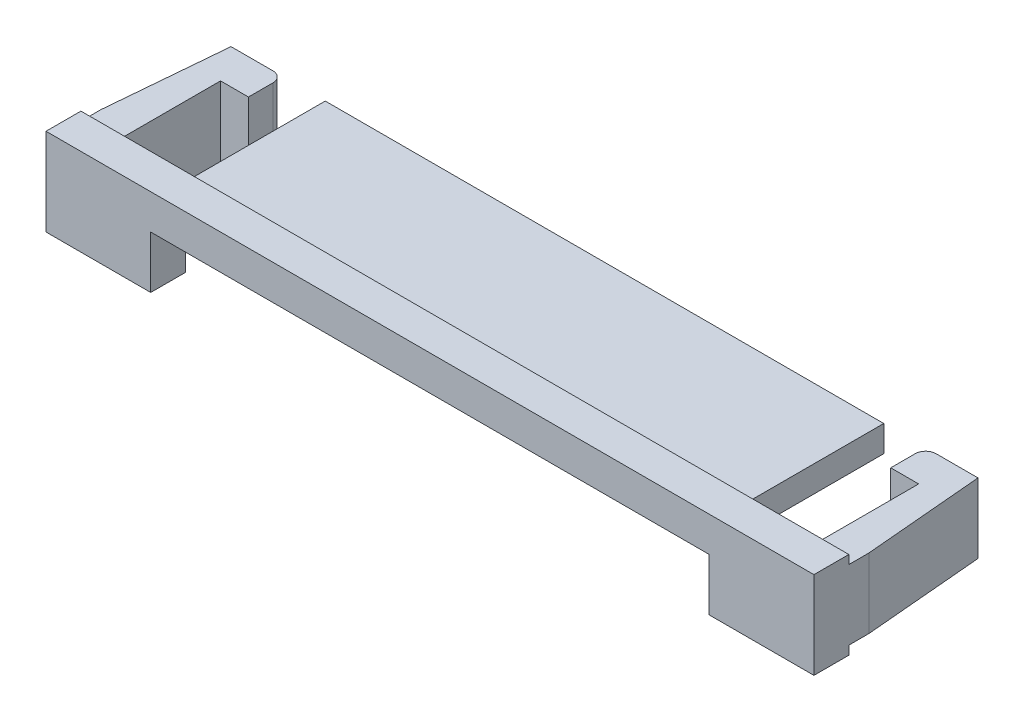
ISO-10303-21;
HEADER;
FILE_DESCRIPTION(('STEP AP214'),'2;1');
FILE_NAME('part.step','',(''),(''),'','','');
FILE_SCHEMA(('AUTOMOTIVE_DESIGN { 1 0 10303 214 1 1 1 1 }'));
ENDSEC;
DATA;
#1=APPLICATION_CONTEXT('core data for automotive mechanical design processes');
#2=APPLICATION_PROTOCOL_DEFINITION('international standard','automotive_design',2000,#1);
#3=PRODUCT_CONTEXT('',#1,'mechanical');
#4=PRODUCT('Part','Part','',(#3));
#5=PRODUCT_RELATED_PRODUCT_CATEGORY('part','',(#4));
#6=PRODUCT_DEFINITION_FORMATION('','',#4);
#7=PRODUCT_DEFINITION_CONTEXT('part definition',#1,'design');
#8=PRODUCT_DEFINITION('design','',#6,#7);
#9=PRODUCT_DEFINITION_SHAPE('','',#8);
#10=(LENGTH_UNIT() NAMED_UNIT(*) SI_UNIT(.MILLI.,.METRE.));
#11=(NAMED_UNIT(*) PLANE_ANGLE_UNIT() SI_UNIT($,.RADIAN.));
#12=(NAMED_UNIT(*) SI_UNIT($,.STERADIAN.) SOLID_ANGLE_UNIT());
#13=UNCERTAINTY_MEASURE_WITH_UNIT(LENGTH_MEASURE(1.E-05),#10,'distance_accuracy_value','');
#14=(GEOMETRIC_REPRESENTATION_CONTEXT(3) GLOBAL_UNCERTAINTY_ASSIGNED_CONTEXT((#13)) GLOBAL_UNIT_ASSIGNED_CONTEXT((#10,
#11,#12)) REPRESENTATION_CONTEXT('',''));
#15=CARTESIAN_POINT('',(0.,0.,0.));
#16=DIRECTION('',(0.,0.,1.));
#17=DIRECTION('',(1.,0.,0.));
#18=AXIS2_PLACEMENT_3D('',#15,#16,#17);
#19=CARTESIAN_POINT('',(-11.,-1.25,5.));
#20=DIRECTION('',(0.,1.,0.));
#21=DIRECTION('',(0.,0.,1.));
#22=AXIS2_PLACEMENT_3D('',#19,#20,#21);
#23=PLANE('',#22);
#24=DIRECTION('',(1.,0.,0.));
#25=VECTOR('',#24,1.);
#26=CARTESIAN_POINT('',(-11.,-1.25,5.));
#27=LINE('',#26,#25);
#28=CARTESIAN_POINT('',(8.,-1.25,5.));
#29=VERTEX_POINT('',#28);
#30=CARTESIAN_POINT('',(11.,-1.25,5.));
#31=VERTEX_POINT('',#30);
#32=EDGE_CURVE('E414',#29,#31,#27,.T.);
#33=ORIENTED_EDGE('',*,*,#32,.F.);
#34=DIRECTION('',(0.,0.,-1.));
#35=VECTOR('',#34,1.);
#36=CARTESIAN_POINT('',(8.,-1.25,5.));
#37=LINE('',#36,#35);
#38=CARTESIAN_POINT('',(8.,-1.25,4.));
#39=VERTEX_POINT('',#38);
#40=EDGE_CURVE('E285',#29,#39,#37,.T.);
#41=ORIENTED_EDGE('',*,*,#40,.T.);
#42=DIRECTION('',(-1.,0.,0.));
#43=VECTOR('',#42,1.);
#44=CARTESIAN_POINT('',(-11.,-1.25,4.));
#45=LINE('',#44,#43);
#46=CARTESIAN_POINT('',(11.,-1.25,4.));
#47=VERTEX_POINT('',#46);
#48=EDGE_CURVE('E392',#47,#39,#45,.T.);
#49=ORIENTED_EDGE('',*,*,#48,.F.);
#50=DIRECTION('',(0.,0.,-1.));
#51=VECTOR('',#50,1.);
#52=CARTESIAN_POINT('',(11.,-1.25,5.));
#53=LINE('',#52,#51);
#54=EDGE_CURVE('E419',#31,#47,#53,.T.);
#55=ORIENTED_EDGE('',*,*,#54,.F.);
#56=EDGE_LOOP('',(#33,#41,#49,#55));
#57=FACE_BOUND('',#56,.T.);
#58=ADVANCED_FACE('F38',(#57),#23,.F.);
#59=CARTESIAN_POINT('',(0.,0.,0.));
#60=DIRECTION('',(0.,0.,1.));
#61=DIRECTION('',(1.,0.,0.));
#62=AXIS2_PLACEMENT_3D('',#59,#60,#61);
#63=PLANE('',#62);
#64=DIRECTION('',(-1.,0.,0.));
#65=VECTOR('',#64,1.);
#66=CARTESIAN_POINT('',(11.,1.,0.));
#67=LINE('',#66,#65);
#68=CARTESIAN_POINT('',(10.7,1.,0.));
#69=VERTEX_POINT('',#68);
#70=CARTESIAN_POINT('',(9.5,1.,0.));
#71=VERTEX_POINT('',#70);
#72=EDGE_CURVE('E353',#69,#71,#67,.T.);
#73=ORIENTED_EDGE('',*,*,#72,.F.);
#74=DIRECTION('',(0.,-1.,0.));
#75=VECTOR('',#74,1.);
#76=CARTESIAN_POINT('',(10.7,0.,0.));
#77=LINE('',#76,#75);
#78=CARTESIAN_POINT('',(10.7,-1.,0.));
#79=VERTEX_POINT('',#78);
#80=EDGE_CURVE('E478',#69,#79,#77,.T.);
#81=ORIENTED_EDGE('',*,*,#80,.T.);
#82=DIRECTION('',(1.,0.,0.));
#83=VECTOR('',#82,1.);
#84=CARTESIAN_POINT('',(-11.,-1.,0.));
#85=LINE('',#84,#83);
#86=CARTESIAN_POINT('',(9.5,-1.,0.));
#87=VERTEX_POINT('',#86);
#88=EDGE_CURVE('E321',#87,#79,#85,.T.);
#89=ORIENTED_EDGE('',*,*,#88,.F.);
#90=DIRECTION('',(0.,1.,0.));
#91=VECTOR('',#90,1.);
#92=CARTESIAN_POINT('',(9.5,1.,0.));
#93=LINE('',#92,#91);
#94=EDGE_CURVE('E446',#87,#71,#93,.T.);
#95=ORIENTED_EDGE('',*,*,#94,.T.);
#96=EDGE_LOOP('',(#73,#81,#89,#95));
#97=FACE_BOUND('',#96,.T.);
#98=ADVANCED_FACE('F581',(#97),#63,.F.);
#99=CARTESIAN_POINT('',(-10.7,-1.,0.));
#100=VERTEX_POINT('',#99);
#101=CARTESIAN_POINT('',(-9.5,-1.,0.));
#102=VERTEX_POINT('',#101);
#103=EDGE_CURVE('E383',#100,#102,#85,.T.);
#104=ORIENTED_EDGE('',*,*,#103,.F.);
#105=DIRECTION('',(0.,1.,0.));
#106=VECTOR('',#105,1.);
#107=CARTESIAN_POINT('',(-10.7,0.,0.));
#108=LINE('',#107,#106);
#109=CARTESIAN_POINT('',(-10.7,1.,0.));
#110=VERTEX_POINT('',#109);
#111=EDGE_CURVE('E47',#100,#110,#108,.T.);
#112=ORIENTED_EDGE('',*,*,#111,.T.);
#113=CARTESIAN_POINT('',(-9.5,1.,0.));
#114=VERTEX_POINT('',#113);
#115=EDGE_CURVE('E369',#114,#110,#67,.T.);
#116=ORIENTED_EDGE('',*,*,#115,.F.);
#117=DIRECTION('',(0.,1.,0.));
#118=VECTOR('',#117,1.);
#119=CARTESIAN_POINT('',(-9.5,-1.,0.));
#120=LINE('',#119,#118);
#121=EDGE_CURVE('E464',#114,#102,#120,.F.);
#122=ORIENTED_EDGE('',*,*,#121,.T.);
#123=EDGE_LOOP('',(#104,#112,#116,#122));
#124=FACE_BOUND('',#123,.T.);
#125=ADVANCED_FACE('F587',(#124),#63,.F.);
#126=CARTESIAN_POINT('',(-11.,-1.,4.));
#127=DIRECTION('',(0.,1.,0.));
#128=DIRECTION('',(-1.,0.,0.));
#129=AXIS2_PLACEMENT_3D('',#126,#127,#128);
#130=PLANE('',#129);
#131=ORIENTED_EDGE('',*,*,#88,.T.);
#132=DIRECTION('',(-0.0871557427476589,0.,-0.996194698091746));
#133=VECTOR('',#132,1.);
#134=CARTESIAN_POINT('',(11.,-1.,3.42901569082837));
#135=LINE('',#134,#133);
#136=CARTESIAN_POINT('',(11.,-1.,3.42901569082837));
#137=VERTEX_POINT('',#136);
#138=EDGE_CURVE('E481',#79,#137,#135,.F.);
#139=ORIENTED_EDGE('',*,*,#138,.T.);
#140=DIRECTION('',(0.,0.,-1.));
#141=VECTOR('',#140,1.);
#142=CARTESIAN_POINT('',(11.,-1.,4.));
#143=LINE('',#142,#141);
#144=CARTESIAN_POINT('',(11.,-1.,4.));
#145=VERTEX_POINT('',#144);
#146=EDGE_CURVE('E399',#145,#137,#143,.T.);
#147=ORIENTED_EDGE('',*,*,#146,.F.);
#148=DIRECTION('',(1.,0.,0.));
#149=VECTOR('',#148,1.);
#150=CARTESIAN_POINT('',(-11.,-1.,4.));
#151=LINE('',#150,#149);
#152=CARTESIAN_POINT('',(10.,-1.,4.));
#153=VERTEX_POINT('',#152);
#154=EDGE_CURVE('E382',#153,#145,#151,.T.);
#155=ORIENTED_EDGE('',*,*,#154,.F.);
#156=DIRECTION('',(0.,0.,-1.));
#157=VECTOR('',#156,1.);
#158=CARTESIAN_POINT('',(10.,-1.,4.));
#159=LINE('',#158,#157);
#160=CARTESIAN_POINT('',(10.,-1.,1.));
#161=VERTEX_POINT('',#160);
#162=EDGE_CURVE('E244',#153,#161,#159,.T.);
#163=ORIENTED_EDGE('',*,*,#162,.T.);
#164=DIRECTION('',(1.,0.,0.));
#165=VECTOR('',#164,1.);
#166=CARTESIAN_POINT('',(11.,-1.,1.));
#167=LINE('',#166,#165);
#168=CARTESIAN_POINT('',(9.2,-1.,1.));
#169=VERTEX_POINT('',#168);
#170=EDGE_CURVE('E229',#169,#161,#167,.T.);
#171=ORIENTED_EDGE('',*,*,#170,.F.);
#172=DIRECTION('',(0.,0.,1.));
#173=VECTOR('',#172,1.);
#174=CARTESIAN_POINT('',(9.2,-1.,0.));
#175=LINE('',#174,#173);
#176=CARTESIAN_POINT('',(9.2,-1.,0.3));
#177=VERTEX_POINT('',#176);
#178=EDGE_CURVE('E217',#177,#169,#175,.T.);
#179=ORIENTED_EDGE('',*,*,#178,.F.);
#180=CARTESIAN_POINT('',(9.5,-1.,0.3));
#181=DIRECTION('',(0.,1.,0.));
#182=DIRECTION('',(-1.,0.,0.));
#183=AXIS2_PLACEMENT_3D('',#180,#181,#182);
#184=CIRCLE('',#183,0.3);
#185=EDGE_CURVE('E455',#177,#87,#184,.F.);
#186=ORIENTED_EDGE('',*,*,#185,.T.);
#187=EDGE_LOOP('',(#131,#139,#147,#155,#163,#171,#179,#186));
#188=FACE_BOUND('',#187,.T.);
#189=ADVANCED_FACE('F242',(#188),#130,.F.);
#190=DIRECTION('',(0.,0.,-1.));
#191=VECTOR('',#190,1.);
#192=CARTESIAN_POINT('',(-11.,-1.,4.));
#193=LINE('',#192,#191);
#194=CARTESIAN_POINT('',(-11.,-1.,4.));
#195=VERTEX_POINT('',#194);
#196=CARTESIAN_POINT('',(-11.,-1.,3.42901569082837));
#197=VERTEX_POINT('',#196);
#198=EDGE_CURVE('E396',#195,#197,#193,.T.);
#199=ORIENTED_EDGE('',*,*,#198,.T.);
#200=DIRECTION('',(-0.0871557427476589,0.,0.996194698091746));
#201=VECTOR('',#200,1.);
#202=CARTESIAN_POINT('',(-11.,-1.,3.42901569082837));
#203=LINE('',#202,#201);
#204=EDGE_CURVE('E61',#197,#100,#203,.F.);
#205=ORIENTED_EDGE('',*,*,#204,.T.);
#206=ORIENTED_EDGE('',*,*,#103,.T.);
#207=CARTESIAN_POINT('',(-9.5,-1.,0.3));
#208=DIRECTION('',(0.,1.,0.));
#209=DIRECTION('',(-1.,0.,0.));
#210=AXIS2_PLACEMENT_3D('',#207,#208,#209);
#211=CIRCLE('',#210,0.3);
#212=CARTESIAN_POINT('',(-9.2,-1.,0.3));
#213=VERTEX_POINT('',#212);
#214=EDGE_CURVE('E468',#102,#213,#211,.F.);
#215=ORIENTED_EDGE('',*,*,#214,.T.);
#216=DIRECTION('',(0.,0.,-1.));
#217=VECTOR('',#216,1.);
#218=CARTESIAN_POINT('',(-9.2,-1.,0.));
#219=LINE('',#218,#217);
#220=CARTESIAN_POINT('',(-9.2,-1.,1.));
#221=VERTEX_POINT('',#220);
#222=EDGE_CURVE('E258',#221,#213,#219,.T.);
#223=ORIENTED_EDGE('',*,*,#222,.F.);
#224=DIRECTION('',(1.,0.,0.));
#225=VECTOR('',#224,1.);
#226=CARTESIAN_POINT('',(-11.,-1.,1.));
#227=LINE('',#226,#225);
#228=CARTESIAN_POINT('',(-9.99999999999999,-1.,1.));
#229=VERTEX_POINT('',#228);
#230=EDGE_CURVE('E255',#229,#221,#227,.T.);
#231=ORIENTED_EDGE('',*,*,#230,.F.);
#232=DIRECTION('',(0.,0.,-1.));
#233=VECTOR('',#232,1.);
#234=CARTESIAN_POINT('',(-9.99999999999999,-1.,4.));
#235=LINE('',#234,#233);
#236=CARTESIAN_POINT('',(-9.99999999999999,-1.,4.));
#237=VERTEX_POINT('',#236);
#238=EDGE_CURVE('E317',#237,#229,#235,.T.);
#239=ORIENTED_EDGE('',*,*,#238,.F.);
#240=EDGE_CURVE('E384',#195,#237,#151,.T.);
#241=ORIENTED_EDGE('',*,*,#240,.F.);
#242=EDGE_LOOP('',(#199,#205,#206,#215,#223,#231,#239,#241));
#243=FACE_BOUND('',#242,.T.);
#244=ADVANCED_FACE('F547',(#243),#130,.F.);
#245=CARTESIAN_POINT('',(11.,1.,4.));
#246=DIRECTION('',(0.,-1.,0.));
#247=DIRECTION('',(0.,0.,-1.));
#248=AXIS2_PLACEMENT_3D('',#245,#246,#247);
#249=PLANE('',#248);
#250=DIRECTION('',(0.,0.,-1.));
#251=VECTOR('',#250,1.);
#252=CARTESIAN_POINT('',(11.,1.,4.));
#253=LINE('',#252,#251);
#254=CARTESIAN_POINT('',(11.,1.,4.));
#255=VERTEX_POINT('',#254);
#256=CARTESIAN_POINT('',(11.,1.,3.42901569082837));
#257=VERTEX_POINT('',#256);
#258=EDGE_CURVE('E365',#255,#257,#253,.T.);
#259=ORIENTED_EDGE('',*,*,#258,.T.);
#260=DIRECTION('',(0.0871557427476589,0.,0.996194698091746));
#261=VECTOR('',#260,1.);
#262=CARTESIAN_POINT('',(11.,1.,3.42901569082837));
#263=LINE('',#262,#261);
#264=EDGE_CURVE('E475',#257,#69,#263,.F.);
#265=ORIENTED_EDGE('',*,*,#264,.T.);
#266=ORIENTED_EDGE('',*,*,#72,.T.);
#267=CARTESIAN_POINT('',(9.5,1.,0.3));
#268=DIRECTION('',(0.,-1.,0.));
#269=DIRECTION('',(0.,0.,-1.));
#270=AXIS2_PLACEMENT_3D('',#267,#268,#269);
#271=CIRCLE('',#270,0.3);
#272=CARTESIAN_POINT('',(9.2,1.,0.3));
#273=VERTEX_POINT('',#272);
#274=EDGE_CURVE('E450',#71,#273,#271,.F.);
#275=ORIENTED_EDGE('',*,*,#274,.T.);
#276=DIRECTION('',(0.,0.,1.));
#277=VECTOR('',#276,1.);
#278=CARTESIAN_POINT('',(9.2,1.,0.));
#279=LINE('',#278,#277);
#280=CARTESIAN_POINT('',(9.2,1.,1.));
#281=VERTEX_POINT('',#280);
#282=EDGE_CURVE('E250',#273,#281,#279,.T.);
#283=ORIENTED_EDGE('',*,*,#282,.T.);
#284=DIRECTION('',(1.,0.,0.));
#285=VECTOR('',#284,1.);
#286=CARTESIAN_POINT('',(11.,1.,1.));
#287=LINE('',#286,#285);
#288=CARTESIAN_POINT('',(10.,1.,1.));
#289=VERTEX_POINT('',#288);
#290=EDGE_CURVE('E230',#281,#289,#287,.T.);
#291=ORIENTED_EDGE('',*,*,#290,.T.);
#292=DIRECTION('',(0.,0.,-1.));
#293=VECTOR('',#292,1.);
#294=CARTESIAN_POINT('',(10.,1.,4.));
#295=LINE('',#294,#293);
#296=CARTESIAN_POINT('',(10.,1.,4.));
#297=VERTEX_POINT('',#296);
#298=EDGE_CURVE('E318',#297,#289,#295,.T.);
#299=ORIENTED_EDGE('',*,*,#298,.F.);
#300=DIRECTION('',(-1.,0.,0.));
#301=VECTOR('',#300,1.);
#302=CARTESIAN_POINT('',(11.,1.,4.));
#303=LINE('',#302,#301);
#304=EDGE_CURVE('E354',#255,#297,#303,.T.);
#305=ORIENTED_EDGE('',*,*,#304,.F.);
#306=EDGE_LOOP('',(#259,#265,#266,#275,#283,#291,#299,#305));
#307=FACE_BOUND('',#306,.T.);
#308=ADVANCED_FACE('F569',(#307),#249,.F.);
#309=ORIENTED_EDGE('',*,*,#115,.T.);
#310=DIRECTION('',(0.0871557427476589,0.,-0.996194698091746));
#311=VECTOR('',#310,1.);
#312=CARTESIAN_POINT('',(-11.,1.,3.42901569082837));
#313=LINE('',#312,#311);
#314=CARTESIAN_POINT('',(-11.,1.,3.42901569082837));
#315=VERTEX_POINT('',#314);
#316=EDGE_CURVE('E11',#110,#315,#313,.F.);
#317=ORIENTED_EDGE('',*,*,#316,.T.);
#318=DIRECTION('',(0.,0.,-1.));
#319=VECTOR('',#318,1.);
#320=CARTESIAN_POINT('',(-11.,1.,4.));
#321=LINE('',#320,#319);
#322=CARTESIAN_POINT('',(-11.,1.,4.));
#323=VERTEX_POINT('',#322);
#324=EDGE_CURVE('E370',#323,#315,#321,.T.);
#325=ORIENTED_EDGE('',*,*,#324,.F.);
#326=CARTESIAN_POINT('',(-9.99999999999999,1.,4.));
#327=VERTEX_POINT('',#326);
#328=EDGE_CURVE('E352',#327,#323,#303,.T.);
#329=ORIENTED_EDGE('',*,*,#328,.F.);
#330=DIRECTION('',(0.,0.,-1.));
#331=VECTOR('',#330,1.);
#332=CARTESIAN_POINT('',(-9.99999999999999,1.,4.));
#333=LINE('',#332,#331);
#334=CARTESIAN_POINT('',(-9.99999999999999,1.,1.));
#335=VERTEX_POINT('',#334);
#336=EDGE_CURVE('E335',#327,#335,#333,.T.);
#337=ORIENTED_EDGE('',*,*,#336,.T.);
#338=DIRECTION('',(1.,0.,0.));
#339=VECTOR('',#338,1.);
#340=CARTESIAN_POINT('',(-11.,1.,1.));
#341=LINE('',#340,#339);
#342=CARTESIAN_POINT('',(-9.2,1.,1.));
#343=VERTEX_POINT('',#342);
#344=EDGE_CURVE('E238',#335,#343,#341,.T.);
#345=ORIENTED_EDGE('',*,*,#344,.T.);
#346=DIRECTION('',(0.,0.,-1.));
#347=VECTOR('',#346,1.);
#348=CARTESIAN_POINT('',(-9.2,1.,0.));
#349=LINE('',#348,#347);
#350=CARTESIAN_POINT('',(-9.2,1.,0.3));
#351=VERTEX_POINT('',#350);
#352=EDGE_CURVE('E259',#343,#351,#349,.T.);
#353=ORIENTED_EDGE('',*,*,#352,.T.);
#354=CARTESIAN_POINT('',(-9.5,1.,0.3));
#355=DIRECTION('',(0.,-1.,0.));
#356=DIRECTION('',(0.,0.,-1.));
#357=AXIS2_PLACEMENT_3D('',#354,#355,#356);
#358=CIRCLE('',#357,0.3);
#359=EDGE_CURVE('E461',#351,#114,#358,.F.);
#360=ORIENTED_EDGE('',*,*,#359,.T.);
#361=EDGE_LOOP('',(#309,#317,#325,#329,#337,#345,#353,#360));
#362=FACE_BOUND('',#361,.T.);
#363=ADVANCED_FACE('F555',(#362),#249,.F.);
#364=CARTESIAN_POINT('',(-11.,1.25,5.));
#365=DIRECTION('',(0.,-1.,0.));
#366=DIRECTION('',(0.,0.,-1.));
#367=AXIS2_PLACEMENT_3D('',#364,#365,#366);
#368=PLANE('',#367);
#369=DIRECTION('',(1.,0.,0.));
#370=VECTOR('',#369,1.);
#371=CARTESIAN_POINT('',(11.,1.25,4.));
#372=LINE('',#371,#370);
#373=CARTESIAN_POINT('',(-11.,1.25,4.));
#374=VERTEX_POINT('',#373);
#375=CARTESIAN_POINT('',(11.,1.25,4.));
#376=VERTEX_POINT('',#375);
#377=EDGE_CURVE('E362',#374,#376,#372,.T.);
#378=ORIENTED_EDGE('',*,*,#377,.F.);
#379=DIRECTION('',(0.,0.,-1.));
#380=VECTOR('',#379,1.);
#381=CARTESIAN_POINT('',(-11.,1.25,5.));
#382=LINE('',#381,#380);
#383=CARTESIAN_POINT('',(-11.,1.25,5.));
#384=VERTEX_POINT('',#383);
#385=EDGE_CURVE('E427',#384,#374,#382,.T.);
#386=ORIENTED_EDGE('',*,*,#385,.F.);
#387=DIRECTION('',(-1.,0.,0.));
#388=VECTOR('',#387,1.);
#389=CARTESIAN_POINT('',(-11.,1.25,5.));
#390=LINE('',#389,#388);
#391=CARTESIAN_POINT('',(11.,1.25,5.));
#392=VERTEX_POINT('',#391);
#393=EDGE_CURVE('E408',#392,#384,#390,.T.);
#394=ORIENTED_EDGE('',*,*,#393,.F.);
#395=DIRECTION('',(0.,0.,-1.));
#396=VECTOR('',#395,1.);
#397=CARTESIAN_POINT('',(11.,1.25,5.));
#398=LINE('',#397,#396);
#399=EDGE_CURVE('E431',#392,#376,#398,.T.);
#400=ORIENTED_EDGE('',*,*,#399,.T.);
#401=EDGE_LOOP('',(#378,#386,#394,#400));
#402=FACE_BOUND('',#401,.T.);
#403=ADVANCED_FACE('F561',(#402),#368,.F.);
#404=CARTESIAN_POINT('',(-7.99999999999999,-1.25,4.));
#405=VERTEX_POINT('',#404);
#406=CARTESIAN_POINT('',(-11.,-1.25,4.));
#407=VERTEX_POINT('',#406);
#408=EDGE_CURVE('E391',#405,#407,#45,.T.);
#409=ORIENTED_EDGE('',*,*,#408,.F.);
#410=DIRECTION('',(0.,0.,-1.));
#411=VECTOR('',#410,1.);
#412=CARTESIAN_POINT('',(-7.99999999999999,-1.25,5.));
#413=LINE('',#412,#411);
#414=CARTESIAN_POINT('',(-7.99999999999999,-1.25,5.));
#415=VERTEX_POINT('',#414);
#416=EDGE_CURVE('E298',#415,#405,#413,.T.);
#417=ORIENTED_EDGE('',*,*,#416,.F.);
#418=CARTESIAN_POINT('',(-11.,-1.25,5.));
#419=VERTEX_POINT('',#418);
#420=EDGE_CURVE('E415',#419,#415,#27,.T.);
#421=ORIENTED_EDGE('',*,*,#420,.F.);
#422=DIRECTION('',(0.,0.,-1.));
#423=VECTOR('',#422,1.);
#424=CARTESIAN_POINT('',(-11.,-1.25,5.));
#425=LINE('',#424,#423);
#426=EDGE_CURVE('E423',#419,#407,#425,.T.);
#427=ORIENTED_EDGE('',*,*,#426,.T.);
#428=EDGE_LOOP('',(#409,#417,#421,#427));
#429=FACE_BOUND('',#428,.T.);
#430=ADVANCED_FACE('F539',(#429),#23,.F.);
#431=CARTESIAN_POINT('',(11.,1.25,5.));
#432=DIRECTION('',(-1.,0.,0.));
#433=DIRECTION('',(0.,0.,1.));
#434=AXIS2_PLACEMENT_3D('',#431,#432,#433);
#435=PLANE('',#434);
#436=ORIENTED_EDGE('',*,*,#146,.T.);
#437=DIRECTION('',(0.,1.,0.));
#438=VECTOR('',#437,1.);
#439=CARTESIAN_POINT('',(11.,1.25,3.42901569082837));
#440=LINE('',#439,#438);
#441=EDGE_CURVE('E471',#137,#257,#440,.T.);
#442=ORIENTED_EDGE('',*,*,#441,.T.);
#443=ORIENTED_EDGE('',*,*,#258,.F.);
#444=DIRECTION('',(0.,-1.,0.));
#445=VECTOR('',#444,1.);
#446=CARTESIAN_POINT('',(11.,1.25,4.));
#447=LINE('',#446,#445);
#448=EDGE_CURVE('E348',#376,#255,#447,.T.);
#449=ORIENTED_EDGE('',*,*,#448,.F.);
#450=ORIENTED_EDGE('',*,*,#399,.F.);
#451=DIRECTION('',(0.,1.,0.));
#452=VECTOR('',#451,1.);
#453=CARTESIAN_POINT('',(11.,1.25,5.));
#454=LINE('',#453,#452);
#455=EDGE_CURVE('E374',#31,#392,#454,.T.);
#456=ORIENTED_EDGE('',*,*,#455,.F.);
#457=ORIENTED_EDGE('',*,*,#54,.T.);
#458=DIRECTION('',(0.,-1.,0.));
#459=VECTOR('',#458,1.);
#460=CARTESIAN_POINT('',(11.,-1.25,4.));
#461=LINE('',#460,#459);
#462=EDGE_CURVE('E388',#145,#47,#461,.T.);
#463=ORIENTED_EDGE('',*,*,#462,.F.);
#464=EDGE_LOOP('',(#436,#442,#443,#449,#450,#456,#457,#463));
#465=FACE_BOUND('',#464,.T.);
#466=ADVANCED_FACE('F565',(#465),#435,.F.);
#467=CARTESIAN_POINT('',(-11.,1.25,5.));
#468=DIRECTION('',(1.,0.,0.));
#469=DIRECTION('',(0.,0.,-1.));
#470=AXIS2_PLACEMENT_3D('',#467,#468,#469);
#471=PLANE('',#470);
#472=ORIENTED_EDGE('',*,*,#324,.T.);
#473=DIRECTION('',(0.,-1.,0.));
#474=VECTOR('',#473,1.);
#475=CARTESIAN_POINT('',(-11.,1.25,3.42901569082837));
#476=LINE('',#475,#474);
#477=EDGE_CURVE('E484',#315,#197,#476,.T.);
#478=ORIENTED_EDGE('',*,*,#477,.T.);
#479=ORIENTED_EDGE('',*,*,#198,.F.);
#480=DIRECTION('',(0.,1.,0.));
#481=VECTOR('',#480,1.);
#482=CARTESIAN_POINT('',(-11.,-1.25,4.));
#483=LINE('',#482,#481);
#484=EDGE_CURVE('E378',#407,#195,#483,.T.);
#485=ORIENTED_EDGE('',*,*,#484,.F.);
#486=ORIENTED_EDGE('',*,*,#426,.F.);
#487=DIRECTION('',(0.,-1.,0.));
#488=VECTOR('',#487,1.);
#489=CARTESIAN_POINT('',(-11.,1.25,5.));
#490=LINE('',#489,#488);
#491=EDGE_CURVE('E411',#384,#419,#490,.T.);
#492=ORIENTED_EDGE('',*,*,#491,.F.);
#493=ORIENTED_EDGE('',*,*,#385,.T.);
#494=DIRECTION('',(0.,1.,0.));
#495=VECTOR('',#494,1.);
#496=CARTESIAN_POINT('',(-11.,1.25,4.));
#497=LINE('',#496,#495);
#498=EDGE_CURVE('E358',#323,#374,#497,.T.);
#499=ORIENTED_EDGE('',*,*,#498,.F.);
#500=EDGE_LOOP('',(#472,#478,#479,#485,#486,#492,#493,#499));
#501=FACE_BOUND('',#500,.T.);
#502=ADVANCED_FACE('F544',(#501),#471,.F.);
#503=CARTESIAN_POINT('',(0.,0.,5.));
#504=DIRECTION('',(0.,0.,1.));
#505=DIRECTION('',(1.,0.,0.));
#506=AXIS2_PLACEMENT_3D('',#503,#504,#505);
#507=PLANE('',#506);
#508=DIRECTION('',(0.,-1.,0.));
#509=VECTOR('',#508,1.);
#510=CARTESIAN_POINT('',(8.,0.25,5.));
#511=LINE('',#510,#509);
#512=CARTESIAN_POINT('',(8.,0.25,5.));
#513=VERTEX_POINT('',#512);
#514=EDGE_CURVE('E273',#513,#29,#511,.T.);
#515=ORIENTED_EDGE('',*,*,#514,.T.);
#516=ORIENTED_EDGE('',*,*,#32,.T.);
#517=ORIENTED_EDGE('',*,*,#455,.T.);
#518=ORIENTED_EDGE('',*,*,#393,.T.);
#519=ORIENTED_EDGE('',*,*,#491,.T.);
#520=ORIENTED_EDGE('',*,*,#420,.T.);
#521=DIRECTION('',(0.,1.,0.));
#522=VECTOR('',#521,1.);
#523=CARTESIAN_POINT('',(-7.99999999999999,0.25,5.));
#524=LINE('',#523,#522);
#525=CARTESIAN_POINT('',(-7.99999999999999,0.25,5.));
#526=VERTEX_POINT('',#525);
#527=EDGE_CURVE('E277',#415,#526,#524,.T.);
#528=ORIENTED_EDGE('',*,*,#527,.T.);
#529=DIRECTION('',(1.,0.,0.));
#530=VECTOR('',#529,1.);
#531=CARTESIAN_POINT('',(8.,0.25,5.));
#532=LINE('',#531,#530);
#533=EDGE_CURVE('E281',#526,#513,#532,.T.);
#534=ORIENTED_EDGE('',*,*,#533,.T.);
#535=EDGE_LOOP('',(#515,#516,#517,#518,#519,#520,#528,#534));
#536=FACE_BOUND('',#535,.T.);
#537=ADVANCED_FACE('F532',(#536),#507,.T.);
#538=DIRECTION('',(0.,1.,0.));
#539=VECTOR('',#538,1.);
#540=CARTESIAN_POINT('',(8.,1.,0.));
#541=LINE('',#540,#539);
#542=CARTESIAN_POINT('',(8.,0.25,0.));
#543=VERTEX_POINT('',#542);
#544=CARTESIAN_POINT('',(8.,1.,0.));
#545=VERTEX_POINT('',#544);
#546=EDGE_CURVE('E310',#543,#545,#541,.T.);
#547=ORIENTED_EDGE('',*,*,#546,.F.);
#548=DIRECTION('',(1.,0.,0.));
#549=VECTOR('',#548,1.);
#550=CARTESIAN_POINT('',(8.,0.25,0.));
#551=LINE('',#550,#549);
#552=CARTESIAN_POINT('',(-7.99999999999999,0.25,0.));
#553=VERTEX_POINT('',#552);
#554=EDGE_CURVE('E272',#553,#543,#551,.T.);
#555=ORIENTED_EDGE('',*,*,#554,.F.);
#556=DIRECTION('',(0.,-1.,0.));
#557=VECTOR('',#556,1.);
#558=CARTESIAN_POINT('',(-7.99999999999999,1.,0.));
#559=LINE('',#558,#557);
#560=CARTESIAN_POINT('',(-7.99999999999999,1.,0.));
#561=VERTEX_POINT('',#560);
#562=EDGE_CURVE('E292',#561,#553,#559,.T.);
#563=ORIENTED_EDGE('',*,*,#562,.F.);
#564=EDGE_CURVE('E368',#545,#561,#67,.T.);
#565=ORIENTED_EDGE('',*,*,#564,.F.);
#566=EDGE_LOOP('',(#547,#555,#563,#565));
#567=FACE_BOUND('',#566,.T.);
#568=ADVANCED_FACE('F513',(#567),#63,.F.);
#569=CARTESIAN_POINT('',(8.,1.,4.));
#570=VERTEX_POINT('',#569);
#571=CARTESIAN_POINT('',(-7.99999999999999,1.,4.));
#572=VERTEX_POINT('',#571);
#573=EDGE_CURVE('E359',#570,#572,#303,.T.);
#574=ORIENTED_EDGE('',*,*,#573,.F.);
#575=DIRECTION('',(0.,0.,-1.));
#576=VECTOR('',#575,1.);
#577=CARTESIAN_POINT('',(8.,1.,4.));
#578=LINE('',#577,#576);
#579=EDGE_CURVE('E322',#570,#545,#578,.T.);
#580=ORIENTED_EDGE('',*,*,#579,.T.);
#581=ORIENTED_EDGE('',*,*,#564,.T.);
#582=DIRECTION('',(0.,0.,-1.));
#583=VECTOR('',#582,1.);
#584=CARTESIAN_POINT('',(-7.99999999999999,1.,4.));
#585=LINE('',#584,#583);
#586=EDGE_CURVE('E342',#572,#561,#585,.T.);
#587=ORIENTED_EDGE('',*,*,#586,.F.);
#588=EDGE_LOOP('',(#574,#580,#581,#587));
#589=FACE_BOUND('',#588,.T.);
#590=ADVANCED_FACE('F508',(#589),#249,.F.);
#591=CARTESIAN_POINT('',(0.,0.,4.));
#592=DIRECTION('',(0.,0.,-1.));
#593=DIRECTION('',(-1.,0.,0.));
#594=AXIS2_PLACEMENT_3D('',#591,#592,#593);
#595=PLANE('',#594);
#596=ORIENTED_EDGE('',*,*,#48,.T.);
#597=DIRECTION('',(0.,1.,0.));
#598=VECTOR('',#597,1.);
#599=CARTESIAN_POINT('',(8.,1.,4.));
#600=LINE('',#599,#598);
#601=CARTESIAN_POINT('',(8.,0.25,4.));
#602=VERTEX_POINT('',#601);
#603=EDGE_CURVE('E311',#39,#602,#600,.T.);
#604=ORIENTED_EDGE('',*,*,#603,.T.);
#605=EDGE_CURVE('E309',#602,#570,#600,.T.);
#606=ORIENTED_EDGE('',*,*,#605,.T.);
#607=ORIENTED_EDGE('',*,*,#573,.T.);
#608=DIRECTION('',(0.,-1.,0.));
#609=VECTOR('',#608,1.);
#610=CARTESIAN_POINT('',(-7.99999999999999,1.,4.));
#611=LINE('',#610,#609);
#612=CARTESIAN_POINT('',(-7.99999999999999,0.25,4.));
#613=VERTEX_POINT('',#612);
#614=EDGE_CURVE('E331',#572,#613,#611,.T.);
#615=ORIENTED_EDGE('',*,*,#614,.T.);
#616=EDGE_CURVE('E330',#613,#405,#611,.T.);
#617=ORIENTED_EDGE('',*,*,#616,.T.);
#618=ORIENTED_EDGE('',*,*,#408,.T.);
#619=ORIENTED_EDGE('',*,*,#484,.T.);
#620=ORIENTED_EDGE('',*,*,#240,.T.);
#621=DIRECTION('',(0.,1.,0.));
#622=VECTOR('',#621,1.);
#623=CARTESIAN_POINT('',(-9.99999999999999,1.,4.));
#624=LINE('',#623,#622);
#625=EDGE_CURVE('E327',#237,#327,#624,.T.);
#626=ORIENTED_EDGE('',*,*,#625,.T.);
#627=ORIENTED_EDGE('',*,*,#328,.T.);
#628=ORIENTED_EDGE('',*,*,#498,.T.);
#629=ORIENTED_EDGE('',*,*,#377,.T.);
#630=ORIENTED_EDGE('',*,*,#448,.T.);
#631=ORIENTED_EDGE('',*,*,#304,.T.);
#632=DIRECTION('',(0.,-1.,0.));
#633=VECTOR('',#632,1.);
#634=CARTESIAN_POINT('',(10.,1.,4.));
#635=LINE('',#634,#633);
#636=EDGE_CURVE('E305',#297,#153,#635,.T.);
#637=ORIENTED_EDGE('',*,*,#636,.T.);
#638=ORIENTED_EDGE('',*,*,#154,.T.);
#639=ORIENTED_EDGE('',*,*,#462,.T.);
#640=EDGE_LOOP('',(#596,#604,#606,#607,#615,#617,#618,#619,#620,#626,#627,#628,#629,#630,#631,
#637,#638,#639));
#641=FACE_BOUND('',#640,.T.);
#642=ADVANCED_FACE('F519',(#641),#595,.T.);
#643=CARTESIAN_POINT('',(-9.99999999999999,1.,4.));
#644=DIRECTION('',(-1.,0.,0.));
#645=DIRECTION('',(0.,0.,1.));
#646=AXIS2_PLACEMENT_3D('',#643,#644,#645);
#647=PLANE('',#646);
#648=ORIENTED_EDGE('',*,*,#238,.T.);
#649=DIRECTION('',(0.,1.,0.));
#650=VECTOR('',#649,1.);
#651=CARTESIAN_POINT('',(-9.99999999999999,1.,1.));
#652=LINE('',#651,#650);
#653=EDGE_CURVE('E439',#229,#335,#652,.T.);
#654=ORIENTED_EDGE('',*,*,#653,.T.);
#655=ORIENTED_EDGE('',*,*,#336,.F.);
#656=ORIENTED_EDGE('',*,*,#625,.F.);
#657=EDGE_LOOP('',(#648,#654,#655,#656));
#658=FACE_BOUND('',#657,.T.);
#659=ADVANCED_FACE('F554',(#658),#647,.F.);
#660=CARTESIAN_POINT('',(-7.99999999999999,1.,4.));
#661=DIRECTION('',(1.,0.,0.));
#662=DIRECTION('',(0.,0.,-1.));
#663=AXIS2_PLACEMENT_3D('',#660,#661,#662);
#664=PLANE('',#663);
#665=ORIENTED_EDGE('',*,*,#562,.T.);
#666=DIRECTION('',(0.,0.,-1.));
#667=VECTOR('',#666,1.);
#668=CARTESIAN_POINT('',(-7.99999999999999,0.25,5.));
#669=LINE('',#668,#667);
#670=EDGE_CURVE('E297',#613,#553,#669,.T.);
#671=ORIENTED_EDGE('',*,*,#670,.F.);
#672=ORIENTED_EDGE('',*,*,#614,.F.);
#673=ORIENTED_EDGE('',*,*,#586,.T.);
#674=EDGE_LOOP('',(#665,#671,#672,#673));
#675=FACE_BOUND('',#674,.T.);
#676=ADVANCED_FACE('F517',(#675),#664,.F.);
#677=CARTESIAN_POINT('',(10.,1.,4.));
#678=DIRECTION('',(1.,0.,0.));
#679=DIRECTION('',(0.,0.,-1.));
#680=AXIS2_PLACEMENT_3D('',#677,#678,#679);
#681=PLANE('',#680);
#682=ORIENTED_EDGE('',*,*,#298,.T.);
#683=DIRECTION('',(0.,-1.,0.));
#684=VECTOR('',#683,1.);
#685=CARTESIAN_POINT('',(10.,1.,1.));
#686=LINE('',#685,#684);
#687=EDGE_CURVE('E443',#289,#161,#686,.T.);
#688=ORIENTED_EDGE('',*,*,#687,.T.);
#689=ORIENTED_EDGE('',*,*,#162,.F.);
#690=ORIENTED_EDGE('',*,*,#636,.F.);
#691=EDGE_LOOP('',(#682,#688,#689,#690));
#692=FACE_BOUND('',#691,.T.);
#693=ADVANCED_FACE('F571',(#692),#681,.F.);
#694=CARTESIAN_POINT('',(8.,1.,4.));
#695=DIRECTION('',(-1.,0.,0.));
#696=DIRECTION('',(0.,-1.,0.));
#697=AXIS2_PLACEMENT_3D('',#694,#695,#696);
#698=PLANE('',#697);
#699=ORIENTED_EDGE('',*,*,#605,.F.);
#700=DIRECTION('',(0.,0.,-1.));
#701=VECTOR('',#700,1.);
#702=CARTESIAN_POINT('',(8.,0.25,4.));
#703=LINE('',#702,#701);
#704=EDGE_CURVE('E435',#602,#543,#703,.T.);
#705=ORIENTED_EDGE('',*,*,#704,.T.);
#706=ORIENTED_EDGE('',*,*,#546,.T.);
#707=ORIENTED_EDGE('',*,*,#579,.F.);
#708=EDGE_LOOP('',(#699,#705,#706,#707));
#709=FACE_BOUND('',#708,.T.);
#710=ADVANCED_FACE('F523',(#709),#698,.F.);
#711=CARTESIAN_POINT('',(8.,0.25,5.));
#712=DIRECTION('',(1.,0.,0.));
#713=DIRECTION('',(0.,0.,-1.));
#714=AXIS2_PLACEMENT_3D('',#711,#712,#713);
#715=PLANE('',#714);
#716=ORIENTED_EDGE('',*,*,#603,.F.);
#717=ORIENTED_EDGE('',*,*,#40,.F.);
#718=ORIENTED_EDGE('',*,*,#514,.F.);
#719=DIRECTION('',(0.,0.,-1.));
#720=VECTOR('',#719,1.);
#721=CARTESIAN_POINT('',(8.,0.25,5.));
#722=LINE('',#721,#720);
#723=EDGE_CURVE('E288',#513,#602,#722,.T.);
#724=ORIENTED_EDGE('',*,*,#723,.T.);
#725=EDGE_LOOP('',(#716,#717,#718,#724));
#726=FACE_BOUND('',#725,.T.);
#727=ADVANCED_FACE('F529',(#726),#715,.F.);
#728=CARTESIAN_POINT('',(8.,0.25,5.));
#729=DIRECTION('',(0.,1.,0.));
#730=DIRECTION('',(0.,0.,1.));
#731=AXIS2_PLACEMENT_3D('',#728,#729,#730);
#732=PLANE('',#731);
#733=ORIENTED_EDGE('',*,*,#554,.T.);
#734=ORIENTED_EDGE('',*,*,#704,.F.);
#735=ORIENTED_EDGE('',*,*,#723,.F.);
#736=ORIENTED_EDGE('',*,*,#533,.F.);
#737=EDGE_CURVE('E293',#526,#613,#669,.T.);
#738=ORIENTED_EDGE('',*,*,#737,.T.);
#739=ORIENTED_EDGE('',*,*,#670,.T.);
#740=EDGE_LOOP('',(#733,#734,#735,#736,#738,#739));
#741=FACE_BOUND('',#740,.T.);
#742=ADVANCED_FACE('F525',(#741),#732,.F.);
#743=CARTESIAN_POINT('',(-7.99999999999999,0.25,5.));
#744=DIRECTION('',(-1.,0.,0.));
#745=DIRECTION('',(0.,-1.,0.));
#746=AXIS2_PLACEMENT_3D('',#743,#744,#745);
#747=PLANE('',#746);
#748=ORIENTED_EDGE('',*,*,#416,.T.);
#749=ORIENTED_EDGE('',*,*,#616,.F.);
#750=ORIENTED_EDGE('',*,*,#737,.F.);
#751=ORIENTED_EDGE('',*,*,#527,.F.);
#752=EDGE_LOOP('',(#748,#749,#750,#751));
#753=FACE_BOUND('',#752,.T.);
#754=ADVANCED_FACE('F534',(#753),#747,.F.);
#755=CARTESIAN_POINT('',(-11.,-1.,1.));
#756=DIRECTION('',(0.,0.,1.));
#757=DIRECTION('',(1.,0.,0.));
#758=AXIS2_PLACEMENT_3D('',#755,#756,#757);
#759=PLANE('',#758);
#760=ORIENTED_EDGE('',*,*,#653,.F.);
#761=ORIENTED_EDGE('',*,*,#230,.T.);
#762=DIRECTION('',(0.,1.,0.));
#763=VECTOR('',#762,1.);
#764=CARTESIAN_POINT('',(-9.2,-1.,1.));
#765=LINE('',#764,#763);
#766=EDGE_CURVE('E263',#221,#343,#765,.T.);
#767=ORIENTED_EDGE('',*,*,#766,.T.);
#768=ORIENTED_EDGE('',*,*,#344,.F.);
#769=EDGE_LOOP('',(#760,#761,#767,#768));
#770=FACE_BOUND('',#769,.T.);
#771=ADVANCED_FACE('F668',(#770),#759,.T.);
#772=CARTESIAN_POINT('',(-9.2,-1.,0.));
#773=DIRECTION('',(1.,0.,0.));
#774=DIRECTION('',(0.,0.,-1.));
#775=AXIS2_PLACEMENT_3D('',#772,#773,#774);
#776=PLANE('',#775);
#777=ORIENTED_EDGE('',*,*,#222,.T.);
#778=DIRECTION('',(0.,1.,0.));
#779=VECTOR('',#778,1.);
#780=CARTESIAN_POINT('',(-9.2,1.,0.3));
#781=LINE('',#780,#779);
#782=EDGE_CURVE('E457',#213,#351,#781,.T.);
#783=ORIENTED_EDGE('',*,*,#782,.T.);
#784=ORIENTED_EDGE('',*,*,#352,.F.);
#785=ORIENTED_EDGE('',*,*,#766,.F.);
#786=EDGE_LOOP('',(#777,#783,#784,#785));
#787=FACE_BOUND('',#786,.T.);
#788=ADVANCED_FACE('F660',(#787),#776,.T.);
#789=CARTESIAN_POINT('',(11.,-1.,1.));
#790=DIRECTION('',(0.,0.,1.));
#791=DIRECTION('',(1.,0.,0.));
#792=AXIS2_PLACEMENT_3D('',#789,#790,#791);
#793=PLANE('',#792);
#794=ORIENTED_EDGE('',*,*,#687,.F.);
#795=ORIENTED_EDGE('',*,*,#290,.F.);
#796=DIRECTION('',(0.,1.,0.));
#797=VECTOR('',#796,1.);
#798=CARTESIAN_POINT('',(9.2,-1.,1.));
#799=LINE('',#798,#797);
#800=EDGE_CURVE('E221',#169,#281,#799,.T.);
#801=ORIENTED_EDGE('',*,*,#800,.F.);
#802=ORIENTED_EDGE('',*,*,#170,.T.);
#803=EDGE_LOOP('',(#794,#795,#801,#802));
#804=FACE_BOUND('',#803,.T.);
#805=ADVANCED_FACE('F235',(#804),#793,.T.);
#806=CARTESIAN_POINT('',(9.2,-1.,0.));
#807=DIRECTION('',(-1.,0.,0.));
#808=DIRECTION('',(0.,0.,1.));
#809=AXIS2_PLACEMENT_3D('',#806,#807,#808);
#810=PLANE('',#809);
#811=ORIENTED_EDGE('',*,*,#282,.F.);
#812=DIRECTION('',(0.,1.,0.));
#813=VECTOR('',#812,1.);
#814=CARTESIAN_POINT('',(9.2,-1.,0.3));
#815=LINE('',#814,#813);
#816=EDGE_CURVE('E224',#273,#177,#815,.F.);
#817=ORIENTED_EDGE('',*,*,#816,.T.);
#818=ORIENTED_EDGE('',*,*,#178,.T.);
#819=ORIENTED_EDGE('',*,*,#800,.T.);
#820=EDGE_LOOP('',(#811,#817,#818,#819));
#821=FACE_BOUND('',#820,.T.);
#822=ADVANCED_FACE('F220',(#821),#810,.T.);
#823=CARTESIAN_POINT('',(9.5,0.,0.3));
#824=DIRECTION('',(0.,-1.,0.));
#825=DIRECTION('',(0.,0.,-1.));
#826=AXIS2_PLACEMENT_3D('',#823,#824,#825);
#827=CYLINDRICAL_SURFACE('',#826,0.3);
#828=ORIENTED_EDGE('',*,*,#185,.F.);
#829=ORIENTED_EDGE('',*,*,#816,.F.);
#830=ORIENTED_EDGE('',*,*,#274,.F.);
#831=ORIENTED_EDGE('',*,*,#94,.F.);
#832=EDGE_LOOP('',(#828,#829,#830,#831));
#833=FACE_BOUND('',#832,.T.);
#834=ADVANCED_FACE('F603',(#833),#827,.T.);
#835=CARTESIAN_POINT('',(-9.5,-1.,0.3));
#836=DIRECTION('',(0.,-1.,0.));
#837=DIRECTION('',(0.,0.,-1.));
#838=AXIS2_PLACEMENT_3D('',#835,#836,#837);
#839=CYLINDRICAL_SURFACE('',#838,0.3);
#840=ORIENTED_EDGE('',*,*,#214,.F.);
#841=ORIENTED_EDGE('',*,*,#121,.F.);
#842=ORIENTED_EDGE('',*,*,#359,.F.);
#843=ORIENTED_EDGE('',*,*,#782,.F.);
#844=EDGE_LOOP('',(#840,#841,#842,#843));
#845=FACE_BOUND('',#844,.T.);
#846=ADVANCED_FACE('F606',(#845),#839,.T.);
#847=CARTESIAN_POINT('',(11.,1.25,3.42901569082837));
#848=DIRECTION('',(-0.996194698091746,0.,0.0871557427476589));
#849=DIRECTION('',(0.,1.,0.));
#850=AXIS2_PLACEMENT_3D('',#847,#848,#849);
#851=PLANE('',#850);
#852=ORIENTED_EDGE('',*,*,#138,.F.);
#853=ORIENTED_EDGE('',*,*,#80,.F.);
#854=ORIENTED_EDGE('',*,*,#264,.F.);
#855=ORIENTED_EDGE('',*,*,#441,.F.);
#856=EDGE_LOOP('',(#852,#853,#854,#855));
#857=FACE_BOUND('',#856,.T.);
#858=ADVANCED_FACE('F609',(#857),#851,.F.);
#859=CARTESIAN_POINT('',(-11.,1.25,3.42901569082837));
#860=DIRECTION('',(0.996194698091746,0.,0.0871557427476589));
#861=DIRECTION('',(0.,-1.,0.));
#862=AXIS2_PLACEMENT_3D('',#859,#860,#861);
#863=PLANE('',#862);
#864=ORIENTED_EDGE('',*,*,#316,.F.);
#865=ORIENTED_EDGE('',*,*,#111,.F.);
#866=ORIENTED_EDGE('',*,*,#204,.F.);
#867=ORIENTED_EDGE('',*,*,#477,.F.);
#868=EDGE_LOOP('',(#864,#865,#866,#867));
#869=FACE_BOUND('',#868,.T.);
#870=ADVANCED_FACE('F40',(#869),#863,.F.);
#871=CLOSED_SHELL('',(#58,#98,#125,#189,#244,#308,#363,#403,#430,#466,#502,#537,#568,#590,#642,
#659,#676,#693,#710,#727,#742,#754,#771,#788,#805,#822,#834,#846,#858,#870));
#872=MANIFOLD_SOLID_BREP('B2',#871);
#873=ADVANCED_BREP_SHAPE_REPRESENTATION('',(#18,#872),#14);
#874=SHAPE_DEFINITION_REPRESENTATION(#9,#873);
ENDSEC;
END-ISO-10303-21;
